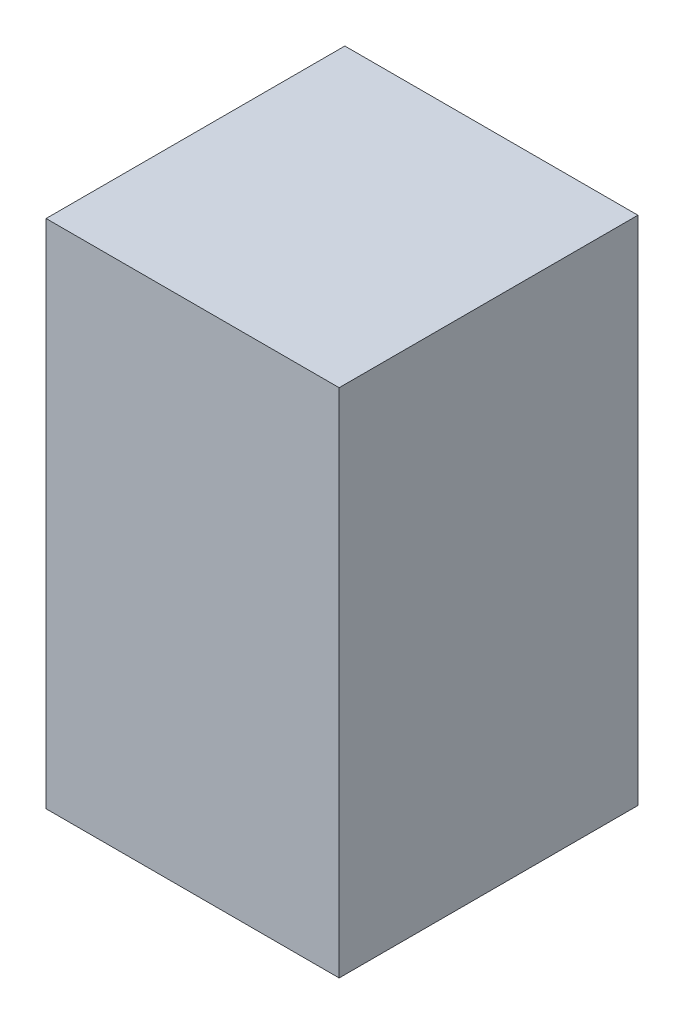
ISO-10303-21;
HEADER;
FILE_DESCRIPTION(('STEP AP214'),'2;1');
FILE_NAME('part.step','',(''),(''),'','','');
FILE_SCHEMA(('AUTOMOTIVE_DESIGN { 1 0 10303 214 1 1 1 1 }'));
ENDSEC;
DATA;
#1=APPLICATION_CONTEXT('core data for automotive mechanical design processes');
#2=APPLICATION_PROTOCOL_DEFINITION('international standard','automotive_design',2000,#1);
#3=PRODUCT_CONTEXT('',#1,'mechanical');
#4=PRODUCT('Part','Part','',(#3));
#5=PRODUCT_RELATED_PRODUCT_CATEGORY('part','',(#4));
#6=PRODUCT_DEFINITION_FORMATION('','',#4);
#7=PRODUCT_DEFINITION_CONTEXT('part definition',#1,'design');
#8=PRODUCT_DEFINITION('design','',#6,#7);
#9=PRODUCT_DEFINITION_SHAPE('','',#8);
#10=(LENGTH_UNIT() NAMED_UNIT(*) SI_UNIT(.MILLI.,.METRE.));
#11=(NAMED_UNIT(*) PLANE_ANGLE_UNIT() SI_UNIT($,.RADIAN.));
#12=(NAMED_UNIT(*) SI_UNIT($,.STERADIAN.) SOLID_ANGLE_UNIT());
#13=UNCERTAINTY_MEASURE_WITH_UNIT(LENGTH_MEASURE(1.E-05),#10,'distance_accuracy_value','');
#14=(GEOMETRIC_REPRESENTATION_CONTEXT(3) GLOBAL_UNCERTAINTY_ASSIGNED_CONTEXT((#13)) GLOBAL_UNIT_ASSIGNED_CONTEXT((#10,
#11,#12)) REPRESENTATION_CONTEXT('',''));
#15=CARTESIAN_POINT('',(0.,0.,0.));
#16=DIRECTION('',(0.,0.,1.));
#17=DIRECTION('',(1.,0.,0.));
#18=AXIS2_PLACEMENT_3D('',#15,#16,#17);
#19=CARTESIAN_POINT('',(0.,20.3219999701977,0.));
#20=DIRECTION('',(0.,1.,0.));
#21=DIRECTION('',(1.,0.,0.));
#22=AXIS2_PLACEMENT_3D('',#19,#20,#21);
#23=PLANE('',#22);
#24=DIRECTION('',(0.,0.,-1.));
#25=VECTOR('',#24,1.);
#26=CARTESIAN_POINT('',(37.29,20.3219999701977,51.25));
#27=LINE('',#26,#25);
#28=CARTESIAN_POINT('',(37.29,20.3219999701977,51.25));
#29=VERTEX_POINT('',#28);
#30=CARTESIAN_POINT('',(37.29,20.3219999701977,40.25));
#31=VERTEX_POINT('',#30);
#32=EDGE_CURVE('E11',#29,#31,#27,.T.);
#33=ORIENTED_EDGE('',*,*,#32,.T.);
#34=DIRECTION('',(-1.,0.,0.));
#35=VECTOR('',#34,1.);
#36=CARTESIAN_POINT('',(37.29,20.3219999701977,40.25));
#37=LINE('',#36,#35);
#38=CARTESIAN_POINT('',(26.5,20.3219999701977,40.25));
#39=VERTEX_POINT('',#38);
#40=EDGE_CURVE('E89',#31,#39,#37,.T.);
#41=ORIENTED_EDGE('',*,*,#40,.T.);
#42=DIRECTION('',(0.,0.,1.));
#43=VECTOR('',#42,1.);
#44=CARTESIAN_POINT('',(26.5,20.3219999701977,40.25));
#45=LINE('',#44,#43);
#46=CARTESIAN_POINT('',(26.5,20.3219999701977,51.25));
#47=VERTEX_POINT('',#46);
#48=EDGE_CURVE('E84',#39,#47,#45,.T.);
#49=ORIENTED_EDGE('',*,*,#48,.T.);
#50=DIRECTION('',(1.,0.,0.));
#51=VECTOR('',#50,1.);
#52=CARTESIAN_POINT('',(26.5,20.3219999701977,51.25));
#53=LINE('',#52,#51);
#54=EDGE_CURVE('E118',#47,#29,#53,.T.);
#55=ORIENTED_EDGE('',*,*,#54,.T.);
#56=EDGE_LOOP('',(#33,#41,#49,#55));
#57=FACE_BOUND('',#56,.T.);
#58=ADVANCED_FACE('F17',(#57),#23,.T.);
#59=CARTESIAN_POINT('',(37.29,1.5,51.25));
#60=DIRECTION('',(1.,0.,0.));
#61=DIRECTION('',(0.,1.,0.));
#62=AXIS2_PLACEMENT_3D('',#59,#60,#61);
#63=PLANE('',#62);
#64=DIRECTION('',(0.,0.,1.));
#65=VECTOR('',#64,1.);
#66=CARTESIAN_POINT('',(37.29,1.5,25.625));
#67=LINE('',#66,#65);
#68=CARTESIAN_POINT('',(37.29,1.5,40.25));
#69=VERTEX_POINT('',#68);
#70=CARTESIAN_POINT('',(37.29,1.5,51.25));
#71=VERTEX_POINT('',#70);
#72=EDGE_CURVE('E101',#69,#71,#67,.T.);
#73=ORIENTED_EDGE('',*,*,#72,.F.);
#74=DIRECTION('',(0.,1.,0.));
#75=VECTOR('',#74,1.);
#76=CARTESIAN_POINT('',(37.29,1.5,40.25));
#77=LINE('',#76,#75);
#78=EDGE_CURVE('E28',#69,#31,#77,.T.);
#79=ORIENTED_EDGE('',*,*,#78,.T.);
#80=ORIENTED_EDGE('',*,*,#32,.F.);
#81=DIRECTION('',(0.,1.,0.));
#82=VECTOR('',#81,1.);
#83=CARTESIAN_POINT('',(37.29,1.5,51.25));
#84=LINE('',#83,#82);
#85=EDGE_CURVE('E59',#71,#29,#84,.T.);
#86=ORIENTED_EDGE('',*,*,#85,.F.);
#87=EDGE_LOOP('',(#73,#79,#80,#86));
#88=FACE_BOUND('',#87,.T.);
#89=ADVANCED_FACE('F19',(#88),#63,.T.);
#90=CARTESIAN_POINT('',(37.29,1.5,40.25));
#91=DIRECTION('',(0.,0.,-1.));
#92=DIRECTION('',(0.,-1.,0.));
#93=AXIS2_PLACEMENT_3D('',#90,#91,#92);
#94=PLANE('',#93);
#95=DIRECTION('',(1.,0.,0.));
#96=VECTOR('',#95,1.);
#97=CARTESIAN_POINT('',(18.645,1.5,40.25));
#98=LINE('',#97,#96);
#99=CARTESIAN_POINT('',(26.5,1.5,40.25));
#100=VERTEX_POINT('',#99);
#101=EDGE_CURVE('E95',#100,#69,#98,.T.);
#102=ORIENTED_EDGE('',*,*,#101,.F.);
#103=DIRECTION('',(0.,1.,0.));
#104=VECTOR('',#103,1.);
#105=CARTESIAN_POINT('',(26.5,1.5,40.25));
#106=LINE('',#105,#104);
#107=EDGE_CURVE('E79',#100,#39,#106,.T.);
#108=ORIENTED_EDGE('',*,*,#107,.T.);
#109=ORIENTED_EDGE('',*,*,#40,.F.);
#110=ORIENTED_EDGE('',*,*,#78,.F.);
#111=EDGE_LOOP('',(#102,#108,#109,#110));
#112=FACE_BOUND('',#111,.T.);
#113=ADVANCED_FACE('F99',(#112),#94,.T.);
#114=CARTESIAN_POINT('',(26.5,1.5,40.25));
#115=DIRECTION('',(-1.,0.,0.));
#116=DIRECTION('',(0.,0.,1.));
#117=AXIS2_PLACEMENT_3D('',#114,#115,#116);
#118=PLANE('',#117);
#119=DIRECTION('',(0.,0.,-1.));
#120=VECTOR('',#119,1.);
#121=CARTESIAN_POINT('',(26.5,1.5,20.125));
#122=LINE('',#121,#120);
#123=CARTESIAN_POINT('',(26.5,1.5,51.25));
#124=VERTEX_POINT('',#123);
#125=EDGE_CURVE('E82',#124,#100,#122,.T.);
#126=ORIENTED_EDGE('',*,*,#125,.F.);
#127=DIRECTION('',(0.,1.,0.));
#128=VECTOR('',#127,1.);
#129=CARTESIAN_POINT('',(26.5,1.5,51.25));
#130=LINE('',#129,#128);
#131=EDGE_CURVE('E21',#124,#47,#130,.T.);
#132=ORIENTED_EDGE('',*,*,#131,.T.);
#133=ORIENTED_EDGE('',*,*,#48,.F.);
#134=ORIENTED_EDGE('',*,*,#107,.F.);
#135=EDGE_LOOP('',(#126,#132,#133,#134));
#136=FACE_BOUND('',#135,.T.);
#137=ADVANCED_FACE('F81',(#136),#118,.T.);
#138=CARTESIAN_POINT('',(26.5,1.5,51.25));
#139=DIRECTION('',(0.,0.,1.));
#140=DIRECTION('',(1.,0.,0.));
#141=AXIS2_PLACEMENT_3D('',#138,#139,#140);
#142=PLANE('',#141);
#143=DIRECTION('',(-1.,0.,0.));
#144=VECTOR('',#143,1.);
#145=CARTESIAN_POINT('',(13.25,1.5,51.25));
#146=LINE('',#145,#144);
#147=EDGE_CURVE('E96',#71,#124,#146,.T.);
#148=ORIENTED_EDGE('',*,*,#147,.F.);
#149=ORIENTED_EDGE('',*,*,#85,.T.);
#150=ORIENTED_EDGE('',*,*,#54,.F.);
#151=ORIENTED_EDGE('',*,*,#131,.F.);
#152=EDGE_LOOP('',(#148,#149,#150,#151));
#153=FACE_BOUND('',#152,.T.);
#154=ADVANCED_FACE('F125',(#153),#142,.T.);
#155=CARTESIAN_POINT('',(-0.14892918312297,1.49999995944139,0.));
#156=DIRECTION('',(0.,-1.,0.));
#157=DIRECTION('',(0.,0.,-1.));
#158=AXIS2_PLACEMENT_3D('',#155,#156,#157);
#159=PLANE('',#158);
#160=ORIENTED_EDGE('',*,*,#101,.T.);
#161=ORIENTED_EDGE('',*,*,#72,.T.);
#162=ORIENTED_EDGE('',*,*,#147,.T.);
#163=ORIENTED_EDGE('',*,*,#125,.T.);
#164=EDGE_LOOP('',(#160,#161,#162,#163));
#165=FACE_BOUND('',#164,.T.);
#166=ADVANCED_FACE('F93',(#165),#159,.T.);
#167=CLOSED_SHELL('',(#58,#89,#113,#137,#154,#166));
#168=MANIFOLD_SOLID_BREP('B1',#167);
#169=ADVANCED_BREP_SHAPE_REPRESENTATION('',(#18,#168),#14);
#170=SHAPE_DEFINITION_REPRESENTATION(#9,#169);
ENDSEC;
END-ISO-10303-21;
